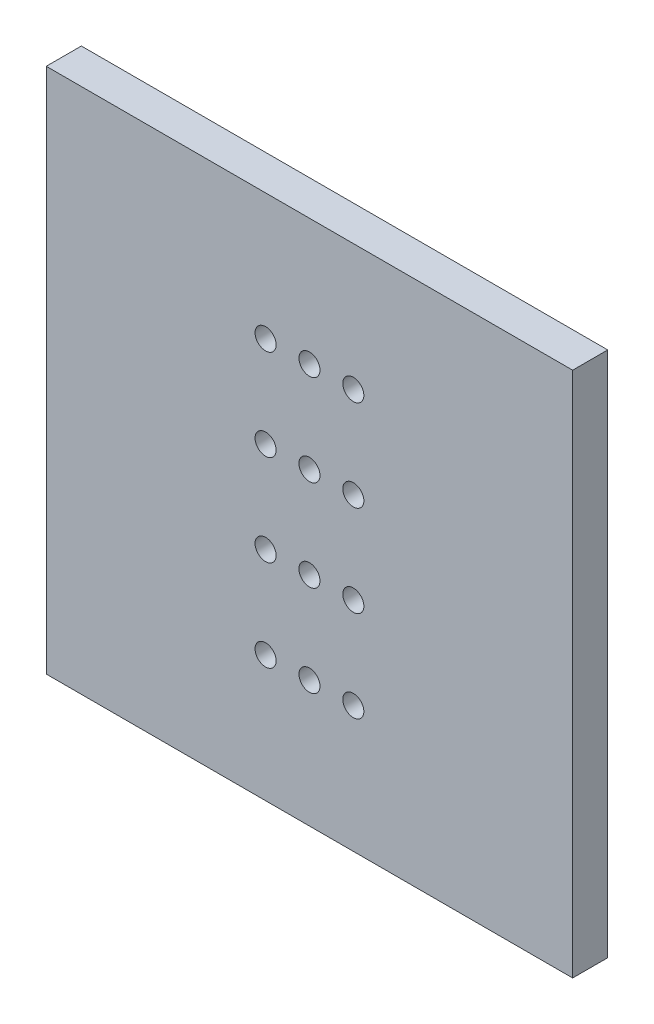
ISO-10303-21;
HEADER;
FILE_DESCRIPTION(('STEP AP214'),'2;1');
FILE_NAME('part.step','',(''),(''),'','','');
FILE_SCHEMA(('AUTOMOTIVE_DESIGN { 1 0 10303 214 1 1 1 1 }'));
ENDSEC;
DATA;
#1=APPLICATION_CONTEXT('core data for automotive mechanical design processes');
#2=APPLICATION_PROTOCOL_DEFINITION('international standard','automotive_design',2000,#1);
#3=PRODUCT_CONTEXT('',#1,'mechanical');
#4=PRODUCT('Part','Part','',(#3));
#5=PRODUCT_RELATED_PRODUCT_CATEGORY('part','',(#4));
#6=PRODUCT_DEFINITION_FORMATION('','',#4);
#7=PRODUCT_DEFINITION_CONTEXT('part definition',#1,'design');
#8=PRODUCT_DEFINITION('design','',#6,#7);
#9=PRODUCT_DEFINITION_SHAPE('','',#8);
#10=(LENGTH_UNIT() NAMED_UNIT(*) SI_UNIT(.MILLI.,.METRE.));
#11=(NAMED_UNIT(*) PLANE_ANGLE_UNIT() SI_UNIT($,.RADIAN.));
#12=(NAMED_UNIT(*) SI_UNIT($,.STERADIAN.) SOLID_ANGLE_UNIT());
#13=UNCERTAINTY_MEASURE_WITH_UNIT(LENGTH_MEASURE(1.E-05),#10,'distance_accuracy_value','');
#14=(GEOMETRIC_REPRESENTATION_CONTEXT(3) GLOBAL_UNCERTAINTY_ASSIGNED_CONTEXT((#13)) GLOBAL_UNIT_ASSIGNED_CONTEXT((#10,
#11,#12)) REPRESENTATION_CONTEXT('',''));
#15=CARTESIAN_POINT('',(0.,0.,0.));
#16=DIRECTION('',(0.,0.,1.));
#17=DIRECTION('',(1.,0.,0.));
#18=AXIS2_PLACEMENT_3D('',#15,#16,#17);
#19=CARTESIAN_POINT('',(15.,-15.,2.));
#20=DIRECTION('',(-1.,0.,0.));
#21=DIRECTION('',(0.,0.,1.));
#22=AXIS2_PLACEMENT_3D('',#19,#20,#21);
#23=PLANE('',#22);
#24=DIRECTION('',(0.,1.,0.));
#25=VECTOR('',#24,1.);
#26=CARTESIAN_POINT('',(15.,-15.,0.));
#27=LINE('',#26,#25);
#28=CARTESIAN_POINT('',(15.,-15.,0.));
#29=VERTEX_POINT('',#28);
#30=CARTESIAN_POINT('',(15.,15.,0.));
#31=VERTEX_POINT('',#30);
#32=EDGE_CURVE('E103',#29,#31,#27,.T.);
#33=ORIENTED_EDGE('',*,*,#32,.T.);
#34=DIRECTION('',(0.,0.,-1.));
#35=VECTOR('',#34,1.);
#36=CARTESIAN_POINT('',(15.,15.,2.));
#37=LINE('',#36,#35);
#38=CARTESIAN_POINT('',(15.,15.,2.));
#39=VERTEX_POINT('',#38);
#40=EDGE_CURVE('E11',#39,#31,#37,.T.);
#41=ORIENTED_EDGE('',*,*,#40,.F.);
#42=DIRECTION('',(0.,1.,0.));
#43=VECTOR('',#42,1.);
#44=CARTESIAN_POINT('',(15.,-15.,2.));
#45=LINE('',#44,#43);
#46=CARTESIAN_POINT('',(15.,-15.,2.));
#47=VERTEX_POINT('',#46);
#48=EDGE_CURVE('E90',#47,#39,#45,.T.);
#49=ORIENTED_EDGE('',*,*,#48,.F.);
#50=DIRECTION('',(0.,0.,-1.));
#51=VECTOR('',#50,1.);
#52=CARTESIAN_POINT('',(15.,-15.,2.));
#53=LINE('',#52,#51);
#54=EDGE_CURVE('E99',#47,#29,#53,.T.);
#55=ORIENTED_EDGE('',*,*,#54,.T.);
#56=EDGE_LOOP('',(#33,#41,#49,#55));
#57=FACE_BOUND('',#56,.T.);
#58=ADVANCED_FACE('F37',(#57),#23,.F.);
#59=CARTESIAN_POINT('',(-15.,15.,2.));
#60=DIRECTION('',(0.,-1.,0.));
#61=DIRECTION('',(0.,0.,-1.));
#62=AXIS2_PLACEMENT_3D('',#59,#60,#61);
#63=PLANE('',#62);
#64=DIRECTION('',(-1.,0.,0.));
#65=VECTOR('',#64,1.);
#66=CARTESIAN_POINT('',(-15.,15.,0.));
#67=LINE('',#66,#65);
#68=CARTESIAN_POINT('',(-15.,15.,0.));
#69=VERTEX_POINT('',#68);
#70=EDGE_CURVE('E94',#31,#69,#67,.T.);
#71=ORIENTED_EDGE('',*,*,#70,.T.);
#72=DIRECTION('',(0.,0.,-1.));
#73=VECTOR('',#72,1.);
#74=CARTESIAN_POINT('',(-15.,15.,2.));
#75=LINE('',#74,#73);
#76=CARTESIAN_POINT('',(-15.,15.,2.));
#77=VERTEX_POINT('',#76);
#78=EDGE_CURVE('E46',#77,#69,#75,.T.);
#79=ORIENTED_EDGE('',*,*,#78,.F.);
#80=DIRECTION('',(-1.,0.,0.));
#81=VECTOR('',#80,1.);
#82=CARTESIAN_POINT('',(-15.,15.,2.));
#83=LINE('',#82,#81);
#84=EDGE_CURVE('E85',#39,#77,#83,.T.);
#85=ORIENTED_EDGE('',*,*,#84,.F.);
#86=ORIENTED_EDGE('',*,*,#40,.T.);
#87=EDGE_LOOP('',(#71,#79,#85,#86));
#88=FACE_BOUND('',#87,.T.);
#89=ADVANCED_FACE('F93',(#88),#63,.F.);
#90=CARTESIAN_POINT('',(-15.,-15.,2.));
#91=DIRECTION('',(1.,0.,0.));
#92=DIRECTION('',(0.,0.,-1.));
#93=AXIS2_PLACEMENT_3D('',#90,#91,#92);
#94=PLANE('',#93);
#95=DIRECTION('',(0.,-1.,0.));
#96=VECTOR('',#95,1.);
#97=CARTESIAN_POINT('',(-15.,-15.,0.));
#98=LINE('',#97,#96);
#99=CARTESIAN_POINT('',(-15.,-15.,0.));
#100=VERTEX_POINT('',#99);
#101=EDGE_CURVE('E72',#69,#100,#98,.T.);
#102=ORIENTED_EDGE('',*,*,#101,.T.);
#103=DIRECTION('',(0.,0.,-1.));
#104=VECTOR('',#103,1.);
#105=CARTESIAN_POINT('',(-15.,-15.,2.));
#106=LINE('',#105,#104);
#107=CARTESIAN_POINT('',(-15.,-15.,2.));
#108=VERTEX_POINT('',#107);
#109=EDGE_CURVE('E95',#108,#100,#106,.T.);
#110=ORIENTED_EDGE('',*,*,#109,.F.);
#111=DIRECTION('',(0.,-1.,0.));
#112=VECTOR('',#111,1.);
#113=CARTESIAN_POINT('',(-15.,-15.,2.));
#114=LINE('',#113,#112);
#115=EDGE_CURVE('E88',#77,#108,#114,.T.);
#116=ORIENTED_EDGE('',*,*,#115,.F.);
#117=ORIENTED_EDGE('',*,*,#78,.T.);
#118=EDGE_LOOP('',(#102,#110,#116,#117));
#119=FACE_BOUND('',#118,.T.);
#120=ADVANCED_FACE('F97',(#119),#94,.F.);
#121=CARTESIAN_POINT('',(-15.,-15.,2.));
#122=DIRECTION('',(0.,1.,0.));
#123=DIRECTION('',(0.,0.,1.));
#124=AXIS2_PLACEMENT_3D('',#121,#122,#123);
#125=PLANE('',#124);
#126=DIRECTION('',(1.,0.,0.));
#127=VECTOR('',#126,1.);
#128=CARTESIAN_POINT('',(-15.,-15.,0.));
#129=LINE('',#128,#127);
#130=EDGE_CURVE('E78',#100,#29,#129,.T.);
#131=ORIENTED_EDGE('',*,*,#130,.T.);
#132=ORIENTED_EDGE('',*,*,#54,.F.);
#133=DIRECTION('',(1.,0.,0.));
#134=VECTOR('',#133,1.);
#135=CARTESIAN_POINT('',(-15.,-15.,2.));
#136=LINE('',#135,#134);
#137=EDGE_CURVE('E55',#108,#47,#136,.T.);
#138=ORIENTED_EDGE('',*,*,#137,.F.);
#139=ORIENTED_EDGE('',*,*,#109,.T.);
#140=EDGE_LOOP('',(#131,#132,#138,#139));
#141=FACE_BOUND('',#140,.T.);
#142=ADVANCED_FACE('F179',(#141),#125,.F.);
#143=CARTESIAN_POINT('',(0.,0.,2.));
#144=DIRECTION('',(0.,0.,-1.));
#145=DIRECTION('',(-1.,0.,0.));
#146=AXIS2_PLACEMENT_3D('',#143,#144,#145);
#147=PLANE('',#146);
#148=CARTESIAN_POINT('',(0.,-2.6,2.));
#149=DIRECTION('',(0.,0.,1.));
#150=DIRECTION('',(1.,0.,0.));
#151=AXIS2_PLACEMENT_3D('',#148,#149,#150);
#152=CIRCLE('',#151,0.6);
#153=CARTESIAN_POINT('',(0.6,-2.6,2.));
#154=VERTEX_POINT('',#153);
#155=EDGE_CURVE('E382',#154,#154,#152,.T.);
#156=ORIENTED_EDGE('',*,*,#155,.F.);
#157=EDGE_LOOP('',(#156));
#158=FACE_BOUND('',#157,.T.);
#159=CARTESIAN_POINT('',(0.,2.6,2.));
#160=DIRECTION('',(0.,0.,1.));
#161=DIRECTION('',(1.,0.,0.));
#162=AXIS2_PLACEMENT_3D('',#159,#160,#161);
#163=CIRCLE('',#162,0.6);
#164=CARTESIAN_POINT('',(0.6,2.6,2.));
#165=VERTEX_POINT('',#164);
#166=EDGE_CURVE('E380',#165,#165,#163,.T.);
#167=ORIENTED_EDGE('',*,*,#166,.F.);
#168=EDGE_LOOP('',(#167));
#169=FACE_BOUND('',#168,.T.);
#170=CARTESIAN_POINT('',(0.,7.8,2.));
#171=DIRECTION('',(0.,0.,1.));
#172=DIRECTION('',(1.,0.,0.));
#173=AXIS2_PLACEMENT_3D('',#170,#171,#172);
#174=CIRCLE('',#173,0.6);
#175=CARTESIAN_POINT('',(0.6,7.8,2.));
#176=VERTEX_POINT('',#175);
#177=EDGE_CURVE('E383',#176,#176,#174,.T.);
#178=ORIENTED_EDGE('',*,*,#177,.F.);
#179=EDGE_LOOP('',(#178));
#180=FACE_BOUND('',#179,.T.);
#181=CARTESIAN_POINT('',(2.5,-7.8,2.));
#182=DIRECTION('',(0.,0.,1.));
#183=DIRECTION('',(1.,0.,0.));
#184=AXIS2_PLACEMENT_3D('',#181,#182,#183);
#185=CIRCLE('',#184,0.6);
#186=CARTESIAN_POINT('',(3.1,-7.8,2.));
#187=VERTEX_POINT('',#186);
#188=EDGE_CURVE('E389',#187,#187,#185,.T.);
#189=ORIENTED_EDGE('',*,*,#188,.F.);
#190=EDGE_LOOP('',(#189));
#191=FACE_BOUND('',#190,.T.);
#192=CARTESIAN_POINT('',(-2.5,-2.6,2.));
#193=DIRECTION('',(0.,0.,1.));
#194=DIRECTION('',(1.,0.,0.));
#195=AXIS2_PLACEMENT_3D('',#192,#193,#194);
#196=CIRCLE('',#195,0.6);
#197=CARTESIAN_POINT('',(-1.9,-2.6,2.));
#198=VERTEX_POINT('',#197);
#199=EDGE_CURVE('E399',#198,#198,#196,.T.);
#200=ORIENTED_EDGE('',*,*,#199,.F.);
#201=EDGE_LOOP('',(#200));
#202=FACE_BOUND('',#201,.T.);
#203=CARTESIAN_POINT('',(-2.5,2.6,2.));
#204=DIRECTION('',(0.,0.,1.));
#205=DIRECTION('',(1.,0.,0.));
#206=AXIS2_PLACEMENT_3D('',#203,#204,#205);
#207=CIRCLE('',#206,0.6);
#208=CARTESIAN_POINT('',(-1.9,2.6,2.));
#209=VERTEX_POINT('',#208);
#210=EDGE_CURVE('E396',#209,#209,#207,.T.);
#211=ORIENTED_EDGE('',*,*,#210,.F.);
#212=EDGE_LOOP('',(#211));
#213=FACE_BOUND('',#212,.T.);
#214=CARTESIAN_POINT('',(-2.5,7.8,2.));
#215=DIRECTION('',(0.,0.,1.));
#216=DIRECTION('',(1.,0.,0.));
#217=AXIS2_PLACEMENT_3D('',#214,#215,#216);
#218=CIRCLE('',#217,0.6);
#219=CARTESIAN_POINT('',(-1.9,7.8,2.));
#220=VERTEX_POINT('',#219);
#221=EDGE_CURVE('E393',#220,#220,#218,.T.);
#222=ORIENTED_EDGE('',*,*,#221,.F.);
#223=EDGE_LOOP('',(#222));
#224=FACE_BOUND('',#223,.T.);
#225=CARTESIAN_POINT('',(0.,-7.8,2.));
#226=DIRECTION('',(0.,0.,1.));
#227=DIRECTION('',(1.,0.,0.));
#228=AXIS2_PLACEMENT_3D('',#225,#226,#227);
#229=CIRCLE('',#228,0.6);
#230=CARTESIAN_POINT('',(0.6,-7.8,2.));
#231=VERTEX_POINT('',#230);
#232=EDGE_CURVE('E386',#231,#231,#229,.T.);
#233=ORIENTED_EDGE('',*,*,#232,.F.);
#234=EDGE_LOOP('',(#233));
#235=FACE_BOUND('',#234,.T.);
#236=CARTESIAN_POINT('',(2.5,-2.6,2.));
#237=DIRECTION('',(0.,0.,1.));
#238=DIRECTION('',(1.,0.,0.));
#239=AXIS2_PLACEMENT_3D('',#236,#237,#238);
#240=CIRCLE('',#239,0.6);
#241=CARTESIAN_POINT('',(3.1,-2.6,2.));
#242=VERTEX_POINT('',#241);
#243=EDGE_CURVE('E419',#242,#242,#240,.T.);
#244=ORIENTED_EDGE('',*,*,#243,.F.);
#245=EDGE_LOOP('',(#244));
#246=FACE_BOUND('',#245,.T.);
#247=CARTESIAN_POINT('',(2.5,2.6,2.));
#248=DIRECTION('',(0.,0.,1.));
#249=DIRECTION('',(1.,0.,0.));
#250=AXIS2_PLACEMENT_3D('',#247,#248,#249);
#251=CIRCLE('',#250,0.6);
#252=CARTESIAN_POINT('',(3.1,2.6,2.));
#253=VERTEX_POINT('',#252);
#254=EDGE_CURVE('E423',#253,#253,#251,.T.);
#255=ORIENTED_EDGE('',*,*,#254,.F.);
#256=EDGE_LOOP('',(#255));
#257=FACE_BOUND('',#256,.T.);
#258=CARTESIAN_POINT('',(2.5,7.8,2.));
#259=DIRECTION('',(0.,0.,1.));
#260=DIRECTION('',(1.,0.,0.));
#261=AXIS2_PLACEMENT_3D('',#258,#259,#260);
#262=CIRCLE('',#261,0.6);
#263=CARTESIAN_POINT('',(3.1,7.8,2.));
#264=VERTEX_POINT('',#263);
#265=EDGE_CURVE('E426',#264,#264,#262,.T.);
#266=ORIENTED_EDGE('',*,*,#265,.F.);
#267=EDGE_LOOP('',(#266));
#268=FACE_BOUND('',#267,.T.);
#269=CARTESIAN_POINT('',(-2.5,-7.8,2.));
#270=DIRECTION('',(0.,0.,1.));
#271=DIRECTION('',(1.,0.,0.));
#272=AXIS2_PLACEMENT_3D('',#269,#270,#271);
#273=CIRCLE('',#272,0.6);
#274=CARTESIAN_POINT('',(-1.9,-7.8,2.));
#275=VERTEX_POINT('',#274);
#276=EDGE_CURVE('E115',#275,#275,#273,.T.);
#277=ORIENTED_EDGE('',*,*,#276,.F.);
#278=EDGE_LOOP('',(#277));
#279=FACE_BOUND('',#278,.T.);
#280=ORIENTED_EDGE('',*,*,#48,.T.);
#281=ORIENTED_EDGE('',*,*,#84,.T.);
#282=ORIENTED_EDGE('',*,*,#115,.T.);
#283=ORIENTED_EDGE('',*,*,#137,.T.);
#284=EDGE_LOOP('',(#280,#281,#282,#283));
#285=FACE_BOUND('',#284,.T.);
#286=ADVANCED_FACE('F86',(#158,#169,#180,#191,#202,#213,#224,#235,#246,#257,#268,#279,#285),
#147,.F.);
#287=CARTESIAN_POINT('',(0.,0.,0.));
#288=DIRECTION('',(0.,0.,-1.));
#289=DIRECTION('',(-1.,0.,0.));
#290=AXIS2_PLACEMENT_3D('',#287,#288,#289);
#291=PLANE('',#290);
#292=CARTESIAN_POINT('',(0.,-2.6,0.));
#293=DIRECTION('',(0.,0.,-1.));
#294=DIRECTION('',(-1.,0.,0.));
#295=AXIS2_PLACEMENT_3D('',#292,#293,#294);
#296=CIRCLE('',#295,0.6);
#297=CARTESIAN_POINT('',(-0.6,-2.6,0.));
#298=VERTEX_POINT('',#297);
#299=EDGE_CURVE('E40',#298,#298,#296,.T.);
#300=ORIENTED_EDGE('',*,*,#299,.F.);
#301=EDGE_LOOP('',(#300));
#302=FACE_BOUND('',#301,.T.);
#303=CARTESIAN_POINT('',(0.,2.6,0.));
#304=DIRECTION('',(0.,0.,-1.));
#305=DIRECTION('',(-1.,0.,0.));
#306=AXIS2_PLACEMENT_3D('',#303,#304,#305);
#307=CIRCLE('',#306,0.6);
#308=CARTESIAN_POINT('',(-0.6,2.6,0.));
#309=VERTEX_POINT('',#308);
#310=EDGE_CURVE('E141',#309,#309,#307,.T.);
#311=ORIENTED_EDGE('',*,*,#310,.F.);
#312=EDGE_LOOP('',(#311));
#313=FACE_BOUND('',#312,.T.);
#314=CARTESIAN_POINT('',(0.,7.8,0.));
#315=DIRECTION('',(0.,0.,-1.));
#316=DIRECTION('',(-1.,0.,0.));
#317=AXIS2_PLACEMENT_3D('',#314,#315,#316);
#318=CIRCLE('',#317,0.6);
#319=CARTESIAN_POINT('',(-0.6,7.8,0.));
#320=VERTEX_POINT('',#319);
#321=EDGE_CURVE('E139',#320,#320,#318,.T.);
#322=ORIENTED_EDGE('',*,*,#321,.F.);
#323=EDGE_LOOP('',(#322));
#324=FACE_BOUND('',#323,.T.);
#325=CARTESIAN_POINT('',(2.5,-7.8,0.));
#326=DIRECTION('',(0.,0.,-1.));
#327=DIRECTION('',(-1.,0.,0.));
#328=AXIS2_PLACEMENT_3D('',#325,#326,#327);
#329=CIRCLE('',#328,0.6);
#330=CARTESIAN_POINT('',(1.9,-7.8,0.));
#331=VERTEX_POINT('',#330);
#332=EDGE_CURVE('E136',#331,#331,#329,.T.);
#333=ORIENTED_EDGE('',*,*,#332,.F.);
#334=EDGE_LOOP('',(#333));
#335=FACE_BOUND('',#334,.T.);
#336=CARTESIAN_POINT('',(-2.5,-2.6,0.));
#337=DIRECTION('',(0.,0.,-1.));
#338=DIRECTION('',(-1.,0.,0.));
#339=AXIS2_PLACEMENT_3D('',#336,#337,#338);
#340=CIRCLE('',#339,0.6);
#341=CARTESIAN_POINT('',(-3.1,-2.6,0.));
#342=VERTEX_POINT('',#341);
#343=EDGE_CURVE('E133',#342,#342,#340,.T.);
#344=ORIENTED_EDGE('',*,*,#343,.F.);
#345=EDGE_LOOP('',(#344));
#346=FACE_BOUND('',#345,.T.);
#347=CARTESIAN_POINT('',(-2.5,2.6,0.));
#348=DIRECTION('',(0.,0.,-1.));
#349=DIRECTION('',(-1.,0.,0.));
#350=AXIS2_PLACEMENT_3D('',#347,#348,#349);
#351=CIRCLE('',#350,0.6);
#352=CARTESIAN_POINT('',(-3.1,2.6,0.));
#353=VERTEX_POINT('',#352);
#354=EDGE_CURVE('E130',#353,#353,#351,.T.);
#355=ORIENTED_EDGE('',*,*,#354,.F.);
#356=EDGE_LOOP('',(#355));
#357=FACE_BOUND('',#356,.T.);
#358=CARTESIAN_POINT('',(-2.5,7.8,0.));
#359=DIRECTION('',(0.,0.,-1.));
#360=DIRECTION('',(-1.,0.,0.));
#361=AXIS2_PLACEMENT_3D('',#358,#359,#360);
#362=CIRCLE('',#361,0.6);
#363=CARTESIAN_POINT('',(-3.1,7.8,0.));
#364=VERTEX_POINT('',#363);
#365=EDGE_CURVE('E127',#364,#364,#362,.T.);
#366=ORIENTED_EDGE('',*,*,#365,.F.);
#367=EDGE_LOOP('',(#366));
#368=FACE_BOUND('',#367,.T.);
#369=CARTESIAN_POINT('',(0.,-7.8,0.));
#370=DIRECTION('',(0.,0.,-1.));
#371=DIRECTION('',(-1.,0.,0.));
#372=AXIS2_PLACEMENT_3D('',#369,#370,#371);
#373=CIRCLE('',#372,0.6);
#374=CARTESIAN_POINT('',(-0.6,-7.8,0.));
#375=VERTEX_POINT('',#374);
#376=EDGE_CURVE('E124',#375,#375,#373,.T.);
#377=ORIENTED_EDGE('',*,*,#376,.F.);
#378=EDGE_LOOP('',(#377));
#379=FACE_BOUND('',#378,.T.);
#380=CARTESIAN_POINT('',(2.5,-2.6,0.));
#381=DIRECTION('',(0.,0.,-1.));
#382=DIRECTION('',(-1.,0.,0.));
#383=AXIS2_PLACEMENT_3D('',#380,#381,#382);
#384=CIRCLE('',#383,0.6);
#385=CARTESIAN_POINT('',(1.9,-2.6,0.));
#386=VERTEX_POINT('',#385);
#387=EDGE_CURVE('E121',#386,#386,#384,.T.);
#388=ORIENTED_EDGE('',*,*,#387,.F.);
#389=EDGE_LOOP('',(#388));
#390=FACE_BOUND('',#389,.T.);
#391=CARTESIAN_POINT('',(2.5,2.6,0.));
#392=DIRECTION('',(0.,0.,-1.));
#393=DIRECTION('',(-1.,0.,0.));
#394=AXIS2_PLACEMENT_3D('',#391,#392,#393);
#395=CIRCLE('',#394,0.6);
#396=CARTESIAN_POINT('',(1.9,2.6,0.));
#397=VERTEX_POINT('',#396);
#398=EDGE_CURVE('E118',#397,#397,#395,.T.);
#399=ORIENTED_EDGE('',*,*,#398,.F.);
#400=EDGE_LOOP('',(#399));
#401=FACE_BOUND('',#400,.T.);
#402=CARTESIAN_POINT('',(2.5,7.8,0.));
#403=DIRECTION('',(0.,0.,-1.));
#404=DIRECTION('',(-1.,0.,0.));
#405=AXIS2_PLACEMENT_3D('',#402,#403,#404);
#406=CIRCLE('',#405,0.6);
#407=CARTESIAN_POINT('',(1.9,7.8,0.));
#408=VERTEX_POINT('',#407);
#409=EDGE_CURVE('E114',#408,#408,#406,.T.);
#410=ORIENTED_EDGE('',*,*,#409,.F.);
#411=EDGE_LOOP('',(#410));
#412=FACE_BOUND('',#411,.T.);
#413=CARTESIAN_POINT('',(-2.5,-7.8,0.));
#414=DIRECTION('',(0.,0.,-1.));
#415=DIRECTION('',(-1.,0.,0.));
#416=AXIS2_PLACEMENT_3D('',#413,#414,#415);
#417=CIRCLE('',#416,0.6);
#418=CARTESIAN_POINT('',(-3.1,-7.8,0.));
#419=VERTEX_POINT('',#418);
#420=EDGE_CURVE('E111',#419,#419,#417,.T.);
#421=ORIENTED_EDGE('',*,*,#420,.F.);
#422=EDGE_LOOP('',(#421));
#423=FACE_BOUND('',#422,.T.);
#424=ORIENTED_EDGE('',*,*,#32,.F.);
#425=ORIENTED_EDGE('',*,*,#130,.F.);
#426=ORIENTED_EDGE('',*,*,#101,.F.);
#427=ORIENTED_EDGE('',*,*,#70,.F.);
#428=EDGE_LOOP('',(#424,#425,#426,#427));
#429=FACE_BOUND('',#428,.T.);
#430=ADVANCED_FACE('F151',(#302,#313,#324,#335,#346,#357,#368,#379,#390,#401,#412,#423,#429),
#291,.T.);
#431=CARTESIAN_POINT('',(-2.5,-7.8,-8.));
#432=DIRECTION('',(0.,0.,1.));
#433=DIRECTION('',(1.,0.,0.));
#434=AXIS2_PLACEMENT_3D('',#431,#432,#433);
#435=CYLINDRICAL_SURFACE('',#434,0.6);
#436=ORIENTED_EDGE('',*,*,#420,.T.);
#437=EDGE_LOOP('',(#436));
#438=FACE_BOUND('',#437,.T.);
#439=ORIENTED_EDGE('',*,*,#276,.T.);
#440=EDGE_LOOP('',(#439));
#441=FACE_BOUND('',#440,.T.);
#442=ADVANCED_FACE('F154',(#438,#441),#435,.F.);
#443=CARTESIAN_POINT('',(2.5,7.8,-8.));
#444=DIRECTION('',(0.,0.,1.));
#445=DIRECTION('',(1.,0.,0.));
#446=AXIS2_PLACEMENT_3D('',#443,#444,#445);
#447=CYLINDRICAL_SURFACE('',#446,0.6);
#448=ORIENTED_EDGE('',*,*,#409,.T.);
#449=EDGE_LOOP('',(#448));
#450=FACE_BOUND('',#449,.T.);
#451=ORIENTED_EDGE('',*,*,#265,.T.);
#452=EDGE_LOOP('',(#451));
#453=FACE_BOUND('',#452,.T.);
#454=ADVANCED_FACE('F228',(#450,#453),#447,.F.);
#455=CARTESIAN_POINT('',(2.5,2.6,-8.));
#456=DIRECTION('',(0.,0.,1.));
#457=DIRECTION('',(1.,0.,0.));
#458=AXIS2_PLACEMENT_3D('',#455,#456,#457);
#459=CYLINDRICAL_SURFACE('',#458,0.6);
#460=ORIENTED_EDGE('',*,*,#398,.T.);
#461=EDGE_LOOP('',(#460));
#462=FACE_BOUND('',#461,.T.);
#463=ORIENTED_EDGE('',*,*,#254,.T.);
#464=EDGE_LOOP('',(#463));
#465=FACE_BOUND('',#464,.T.);
#466=ADVANCED_FACE('F239',(#462,#465),#459,.F.);
#467=CARTESIAN_POINT('',(2.5,-2.6,-8.));
#468=DIRECTION('',(0.,0.,1.));
#469=DIRECTION('',(1.,0.,0.));
#470=AXIS2_PLACEMENT_3D('',#467,#468,#469);
#471=CYLINDRICAL_SURFACE('',#470,0.6);
#472=ORIENTED_EDGE('',*,*,#387,.T.);
#473=EDGE_LOOP('',(#472));
#474=FACE_BOUND('',#473,.T.);
#475=ORIENTED_EDGE('',*,*,#243,.T.);
#476=EDGE_LOOP('',(#475));
#477=FACE_BOUND('',#476,.T.);
#478=ADVANCED_FACE('F250',(#474,#477),#471,.F.);
#479=CARTESIAN_POINT('',(0.,-7.8,-8.));
#480=DIRECTION('',(0.,0.,1.));
#481=DIRECTION('',(1.,0.,0.));
#482=AXIS2_PLACEMENT_3D('',#479,#480,#481);
#483=CYLINDRICAL_SURFACE('',#482,0.6);
#484=ORIENTED_EDGE('',*,*,#376,.T.);
#485=EDGE_LOOP('',(#484));
#486=FACE_BOUND('',#485,.T.);
#487=ORIENTED_EDGE('',*,*,#232,.T.);
#488=EDGE_LOOP('',(#487));
#489=FACE_BOUND('',#488,.T.);
#490=ADVANCED_FACE('F261',(#486,#489),#483,.F.);
#491=CARTESIAN_POINT('',(-2.5,7.8,-8.));
#492=DIRECTION('',(0.,0.,1.));
#493=DIRECTION('',(1.,0.,0.));
#494=AXIS2_PLACEMENT_3D('',#491,#492,#493);
#495=CYLINDRICAL_SURFACE('',#494,0.6);
#496=ORIENTED_EDGE('',*,*,#365,.T.);
#497=EDGE_LOOP('',(#496));
#498=FACE_BOUND('',#497,.T.);
#499=ORIENTED_EDGE('',*,*,#221,.T.);
#500=EDGE_LOOP('',(#499));
#501=FACE_BOUND('',#500,.T.);
#502=ADVANCED_FACE('F272',(#498,#501),#495,.F.);
#503=CARTESIAN_POINT('',(-2.5,2.6,-8.));
#504=DIRECTION('',(0.,0.,1.));
#505=DIRECTION('',(1.,0.,0.));
#506=AXIS2_PLACEMENT_3D('',#503,#504,#505);
#507=CYLINDRICAL_SURFACE('',#506,0.6);
#508=ORIENTED_EDGE('',*,*,#354,.T.);
#509=EDGE_LOOP('',(#508));
#510=FACE_BOUND('',#509,.T.);
#511=ORIENTED_EDGE('',*,*,#210,.T.);
#512=EDGE_LOOP('',(#511));
#513=FACE_BOUND('',#512,.T.);
#514=ADVANCED_FACE('F283',(#510,#513),#507,.F.);
#515=CARTESIAN_POINT('',(-2.5,-2.6,-8.));
#516=DIRECTION('',(0.,0.,1.));
#517=DIRECTION('',(1.,0.,0.));
#518=AXIS2_PLACEMENT_3D('',#515,#516,#517);
#519=CYLINDRICAL_SURFACE('',#518,0.6);
#520=ORIENTED_EDGE('',*,*,#343,.T.);
#521=EDGE_LOOP('',(#520));
#522=FACE_BOUND('',#521,.T.);
#523=ORIENTED_EDGE('',*,*,#199,.T.);
#524=EDGE_LOOP('',(#523));
#525=FACE_BOUND('',#524,.T.);
#526=ADVANCED_FACE('F294',(#522,#525),#519,.F.);
#527=CARTESIAN_POINT('',(2.5,-7.8,-8.));
#528=DIRECTION('',(0.,0.,1.));
#529=DIRECTION('',(1.,0.,0.));
#530=AXIS2_PLACEMENT_3D('',#527,#528,#529);
#531=CYLINDRICAL_SURFACE('',#530,0.6);
#532=ORIENTED_EDGE('',*,*,#332,.T.);
#533=EDGE_LOOP('',(#532));
#534=FACE_BOUND('',#533,.T.);
#535=ORIENTED_EDGE('',*,*,#188,.T.);
#536=EDGE_LOOP('',(#535));
#537=FACE_BOUND('',#536,.T.);
#538=ADVANCED_FACE('F305',(#534,#537),#531,.F.);
#539=CARTESIAN_POINT('',(0.,7.8,-8.));
#540=DIRECTION('',(0.,0.,1.));
#541=DIRECTION('',(1.,0.,0.));
#542=AXIS2_PLACEMENT_3D('',#539,#540,#541);
#543=CYLINDRICAL_SURFACE('',#542,0.6);
#544=ORIENTED_EDGE('',*,*,#321,.T.);
#545=EDGE_LOOP('',(#544));
#546=FACE_BOUND('',#545,.T.);
#547=ORIENTED_EDGE('',*,*,#177,.T.);
#548=EDGE_LOOP('',(#547));
#549=FACE_BOUND('',#548,.T.);
#550=ADVANCED_FACE('F316',(#546,#549),#543,.F.);
#551=CARTESIAN_POINT('',(0.,2.6,-8.));
#552=DIRECTION('',(0.,0.,1.));
#553=DIRECTION('',(1.,0.,0.));
#554=AXIS2_PLACEMENT_3D('',#551,#552,#553);
#555=CYLINDRICAL_SURFACE('',#554,0.6);
#556=ORIENTED_EDGE('',*,*,#310,.T.);
#557=EDGE_LOOP('',(#556));
#558=FACE_BOUND('',#557,.T.);
#559=ORIENTED_EDGE('',*,*,#166,.T.);
#560=EDGE_LOOP('',(#559));
#561=FACE_BOUND('',#560,.T.);
#562=ADVANCED_FACE('F327',(#558,#561),#555,.F.);
#563=CARTESIAN_POINT('',(0.,-2.6,-8.));
#564=DIRECTION('',(0.,0.,1.));
#565=DIRECTION('',(1.,0.,0.));
#566=AXIS2_PLACEMENT_3D('',#563,#564,#565);
#567=CYLINDRICAL_SURFACE('',#566,0.6);
#568=ORIENTED_EDGE('',*,*,#299,.T.);
#569=EDGE_LOOP('',(#568));
#570=FACE_BOUND('',#569,.T.);
#571=ORIENTED_EDGE('',*,*,#155,.T.);
#572=EDGE_LOOP('',(#571));
#573=FACE_BOUND('',#572,.T.);
#574=ADVANCED_FACE('F148',(#570,#573),#567,.F.);
#575=CLOSED_SHELL('',(#58,#89,#120,#142,#286,#430,#442,#454,#466,#478,#490,#502,#514,#526,#538,
#550,#562,#574));
#576=MANIFOLD_SOLID_BREP('B2',#575);
#577=ADVANCED_BREP_SHAPE_REPRESENTATION('',(#18,#576),#14);
#578=SHAPE_DEFINITION_REPRESENTATION(#9,#577);
ENDSEC;
END-ISO-10303-21;
